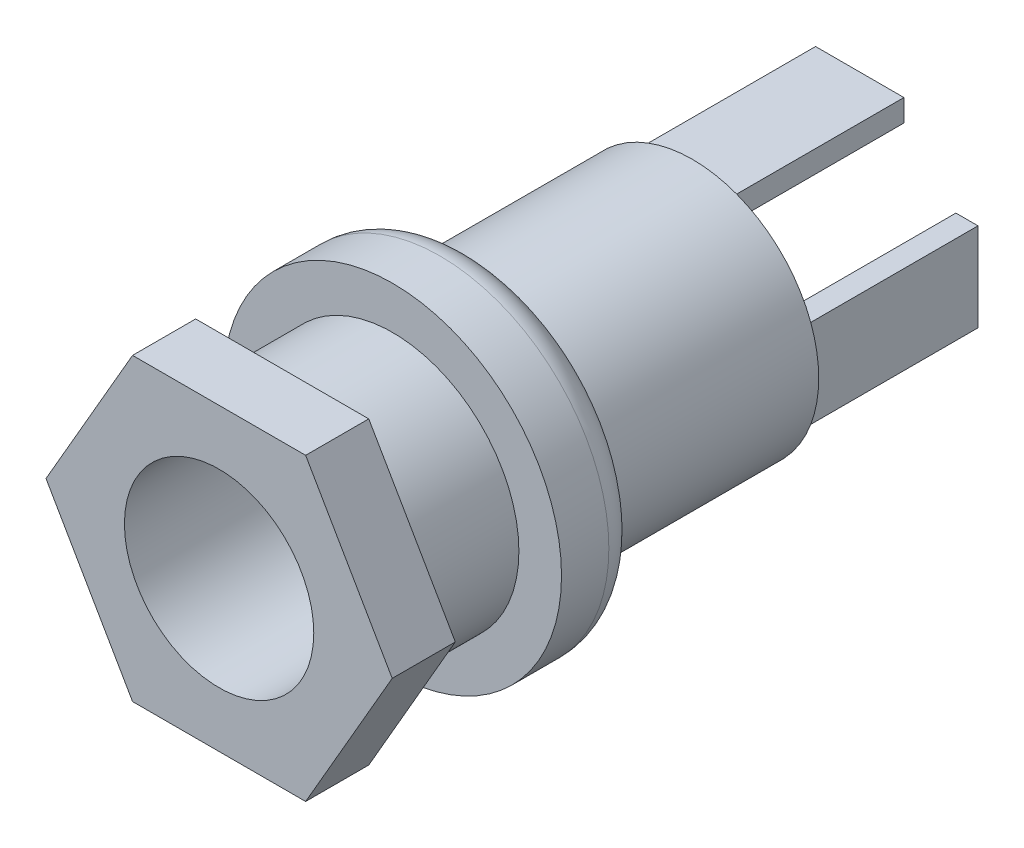
ISO-10303-21;
HEADER;
FILE_DESCRIPTION(('STEP AP214'),'2;1');
FILE_NAME('part.step','',(''),(''),'','','');
FILE_SCHEMA(('AUTOMOTIVE_DESIGN { 1 0 10303 214 1 1 1 1 }'));
ENDSEC;
DATA;
#1=APPLICATION_CONTEXT('core data for automotive mechanical design processes');
#2=APPLICATION_PROTOCOL_DEFINITION('international standard','automotive_design',2000,#1);
#3=PRODUCT_CONTEXT('',#1,'mechanical');
#4=PRODUCT('Part','Part','',(#3));
#5=PRODUCT_RELATED_PRODUCT_CATEGORY('part','',(#4));
#6=PRODUCT_DEFINITION_FORMATION('','',#4);
#7=PRODUCT_DEFINITION_CONTEXT('part definition',#1,'design');
#8=PRODUCT_DEFINITION('design','',#6,#7);
#9=PRODUCT_DEFINITION_SHAPE('','',#8);
#10=(LENGTH_UNIT() NAMED_UNIT(*) SI_UNIT(.MILLI.,.METRE.));
#11=(NAMED_UNIT(*) PLANE_ANGLE_UNIT() SI_UNIT($,.RADIAN.));
#12=(NAMED_UNIT(*) SI_UNIT($,.STERADIAN.) SOLID_ANGLE_UNIT());
#13=UNCERTAINTY_MEASURE_WITH_UNIT(LENGTH_MEASURE(1.E-05),#10,'distance_accuracy_value','');
#14=(GEOMETRIC_REPRESENTATION_CONTEXT(3) GLOBAL_UNCERTAINTY_ASSIGNED_CONTEXT((#13)) GLOBAL_UNIT_ASSIGNED_CONTEXT((#10,
#11,#12)) REPRESENTATION_CONTEXT('',''));
#15=CARTESIAN_POINT('',(0.,0.,0.));
#16=DIRECTION('',(0.,0.,1.));
#17=DIRECTION('',(1.,0.,0.));
#18=AXIS2_PLACEMENT_3D('',#15,#16,#17);
#19=CARTESIAN_POINT('',(0.,0.,-5.5));
#20=DIRECTION('',(0.,0.,1.));
#21=DIRECTION('',(1.,0.,0.));
#22=AXIS2_PLACEMENT_3D('',#19,#20,#21);
#23=CYLINDRICAL_SURFACE('',#22,4.);
#24=CARTESIAN_POINT('',(0.,0.,-5.5));
#25=DIRECTION('',(0.,0.,-1.));
#26=DIRECTION('',(-1.,0.,0.));
#27=AXIS2_PLACEMENT_3D('',#24,#25,#26);
#28=CIRCLE('',#27,4.);
#29=CARTESIAN_POINT('',(-4.,0.,-5.5));
#30=VERTEX_POINT('',#29);
#31=EDGE_CURVE('E319',#30,#30,#28,.F.);
#32=ORIENTED_EDGE('',*,*,#31,.T.);
#33=EDGE_LOOP('',(#32));
#34=FACE_BOUND('',#33,.T.);
#35=CARTESIAN_POINT('',(0.,0.,-2.));
#36=DIRECTION('',(0.,0.,1.));
#37=DIRECTION('',(1.,0.,0.));
#38=AXIS2_PLACEMENT_3D('',#35,#36,#37);
#39=CIRCLE('',#38,4.);
#40=CARTESIAN_POINT('',(4.,0.,-2.));
#41=VERTEX_POINT('',#40);
#42=EDGE_CURVE('E189',#41,#41,#39,.T.);
#43=ORIENTED_EDGE('',*,*,#42,.F.);
#44=EDGE_LOOP('',(#43));
#45=FACE_BOUND('',#44,.T.);
#46=ADVANCED_FACE('F30',(#34,#45),#23,.T.);
#47=CARTESIAN_POINT('',(0.,0.,-15.));
#48=DIRECTION('',(0.,0.,-1.));
#49=DIRECTION('',(-1.,0.,0.));
#50=AXIS2_PLACEMENT_3D('',#47,#48,#49);
#51=PLANE('',#50);
#52=CARTESIAN_POINT('',(0.,0.,-15.));
#53=DIRECTION('',(0.,0.,-1.));
#54=DIRECTION('',(-1.,0.,0.));
#55=AXIS2_PLACEMENT_3D('',#52,#53,#54);
#56=CIRCLE('',#55,4.);
#57=CARTESIAN_POINT('',(-3.74699879903903,-1.4,-15.));
#58=VERTEX_POINT('',#57);
#59=CARTESIAN_POINT('',(-3.74699879903903,1.4,-15.));
#60=VERTEX_POINT('',#59);
#61=EDGE_CURVE('E683',#58,#60,#56,.T.);
#62=ORIENTED_EDGE('',*,*,#61,.T.);
#63=DIRECTION('',(0.,1.,0.));
#64=VECTOR('',#63,1.);
#65=CARTESIAN_POINT('',(-3.74699879903903,-1.4,-15.));
#66=LINE('',#65,#64);
#67=EDGE_CURVE('E211',#58,#60,#66,.T.);
#68=ORIENTED_EDGE('',*,*,#67,.F.);
#69=EDGE_LOOP('',(#62,#68));
#70=FACE_BOUND('',#69,.T.);
#71=ADVANCED_FACE('F341',(#70),#51,.T.);
#72=DIRECTION('',(0.,-1.,0.));
#73=VECTOR('',#72,1.);
#74=CARTESIAN_POINT('',(-3.04699879903904,-1.4,-15.));
#75=LINE('',#74,#73);
#76=CARTESIAN_POINT('',(-3.04699879903904,1.4,-15.));
#77=VERTEX_POINT('',#76);
#78=CARTESIAN_POINT('',(-3.04699879903904,-1.4,-15.));
#79=VERTEX_POINT('',#78);
#80=EDGE_CURVE('E234',#77,#79,#75,.T.);
#81=ORIENTED_EDGE('',*,*,#80,.F.);
#82=DIRECTION('',(1.,0.,0.));
#83=VECTOR('',#82,1.);
#84=CARTESIAN_POINT('',(-3.04699879903904,1.4,-15.));
#85=LINE('',#84,#83);
#86=EDGE_CURVE('E232',#60,#77,#85,.T.);
#87=ORIENTED_EDGE('',*,*,#86,.F.);
#88=CARTESIAN_POINT('',(-1.4,3.74699879903904,-15.));
#89=VERTEX_POINT('',#88);
#90=EDGE_CURVE('E311',#60,#89,#56,.T.);
#91=ORIENTED_EDGE('',*,*,#90,.T.);
#92=DIRECTION('',(0.,1.,0.));
#93=VECTOR('',#92,1.);
#94=CARTESIAN_POINT('',(-1.4,3.04699879903904,-15.));
#95=LINE('',#94,#93);
#96=CARTESIAN_POINT('',(-1.4,3.04699879903904,-15.));
#97=VERTEX_POINT('',#96);
#98=EDGE_CURVE('E289',#97,#89,#95,.T.);
#99=ORIENTED_EDGE('',*,*,#98,.F.);
#100=DIRECTION('',(-1.,0.,0.));
#101=VECTOR('',#100,1.);
#102=CARTESIAN_POINT('',(-1.4,3.04699879903904,-15.));
#103=LINE('',#102,#101);
#104=CARTESIAN_POINT('',(1.4,3.04699879903904,-15.));
#105=VERTEX_POINT('',#104);
#106=EDGE_CURVE('E286',#105,#97,#103,.T.);
#107=ORIENTED_EDGE('',*,*,#106,.F.);
#108=DIRECTION('',(0.,-1.,0.));
#109=VECTOR('',#108,1.);
#110=CARTESIAN_POINT('',(1.4,3.04699879903904,-15.));
#111=LINE('',#110,#109);
#112=CARTESIAN_POINT('',(1.4,3.74699879903903,-15.));
#113=VERTEX_POINT('',#112);
#114=EDGE_CURVE('E272',#113,#105,#111,.T.);
#115=ORIENTED_EDGE('',*,*,#114,.F.);
#116=CARTESIAN_POINT('',(3.74699879903904,1.4,-15.));
#117=VERTEX_POINT('',#116);
#118=EDGE_CURVE('E310',#113,#117,#56,.T.);
#119=ORIENTED_EDGE('',*,*,#118,.T.);
#120=DIRECTION('',(1.,0.,0.));
#121=VECTOR('',#120,1.);
#122=CARTESIAN_POINT('',(3.04699879903904,1.4,-15.));
#123=LINE('',#122,#121);
#124=CARTESIAN_POINT('',(3.04699879903904,1.4,-15.));
#125=VERTEX_POINT('',#124);
#126=EDGE_CURVE('E250',#125,#117,#123,.T.);
#127=ORIENTED_EDGE('',*,*,#126,.F.);
#128=DIRECTION('',(0.,1.,0.));
#129=VECTOR('',#128,1.);
#130=CARTESIAN_POINT('',(3.04699879903903,-1.4,-15.));
#131=LINE('',#130,#129);
#132=CARTESIAN_POINT('',(3.04699879903903,-1.4,-15.));
#133=VERTEX_POINT('',#132);
#134=EDGE_CURVE('E261',#133,#125,#131,.T.);
#135=ORIENTED_EDGE('',*,*,#134,.F.);
#136=DIRECTION('',(-1.,0.,0.));
#137=VECTOR('',#136,1.);
#138=CARTESIAN_POINT('',(3.04699879903903,-1.4,-15.));
#139=LINE('',#138,#137);
#140=CARTESIAN_POINT('',(3.74699879903904,-1.4,-15.));
#141=VERTEX_POINT('',#140);
#142=EDGE_CURVE('E259',#141,#133,#139,.T.);
#143=ORIENTED_EDGE('',*,*,#142,.F.);
#144=EDGE_CURVE('E681',#141,#58,#56,.T.);
#145=ORIENTED_EDGE('',*,*,#144,.T.);
#146=DIRECTION('',(-1.,0.,0.));
#147=VECTOR('',#146,1.);
#148=CARTESIAN_POINT('',(-3.04699879903904,-1.4,-15.));
#149=LINE('',#148,#147);
#150=EDGE_CURVE('E223',#79,#58,#149,.T.);
#151=ORIENTED_EDGE('',*,*,#150,.F.);
#152=EDGE_LOOP('',(#81,#87,#91,#99,#107,#115,#119,#127,#135,#143,#145,#151));
#153=FACE_BOUND('',#152,.T.);
#154=ADVANCED_FACE('F352',(#153),#51,.T.);
#155=EDGE_CURVE('E677',#117,#141,#56,.T.);
#156=ORIENTED_EDGE('',*,*,#155,.T.);
#157=DIRECTION('',(0.,-1.,0.));
#158=VECTOR('',#157,1.);
#159=CARTESIAN_POINT('',(3.74699879903904,-1.4,-15.));
#160=LINE('',#159,#158);
#161=EDGE_CURVE('E245',#117,#141,#160,.T.);
#162=ORIENTED_EDGE('',*,*,#161,.F.);
#163=EDGE_LOOP('',(#156,#162));
#164=FACE_BOUND('',#163,.T.);
#165=ADVANCED_FACE('F342',(#164),#51,.T.);
#166=CARTESIAN_POINT('',(0.,0.,-8.));
#167=DIRECTION('',(0.,0.,-1.));
#168=DIRECTION('',(-1.,0.,0.));
#169=AXIS2_PLACEMENT_3D('',#166,#167,#168);
#170=PLANE('',#169);
#171=CARTESIAN_POINT('',(0.,0.,-8.));
#172=DIRECTION('',(0.,0.,-1.));
#173=DIRECTION('',(-1.,0.,0.));
#174=AXIS2_PLACEMENT_3D('',#171,#172,#173);
#175=CIRCLE('',#174,4.35);
#176=CARTESIAN_POINT('',(-4.35,0.,-8.));
#177=VERTEX_POINT('',#176);
#178=EDGE_CURVE('E38',#177,#177,#175,.T.);
#179=ORIENTED_EDGE('',*,*,#178,.T.);
#180=EDGE_LOOP('',(#179));
#181=FACE_BOUND('',#180,.T.);
#182=CARTESIAN_POINT('',(0.,0.,-8.));
#183=DIRECTION('',(0.,0.,-1.));
#184=DIRECTION('',(-1.,0.,0.));
#185=AXIS2_PLACEMENT_3D('',#182,#183,#184);
#186=CIRCLE('',#185,4.);
#187=CARTESIAN_POINT('',(-4.,0.,-8.));
#188=VERTEX_POINT('',#187);
#189=EDGE_CURVE('E305',#188,#188,#186,.T.);
#190=ORIENTED_EDGE('',*,*,#189,.F.);
#191=EDGE_LOOP('',(#190));
#192=FACE_BOUND('',#191,.T.);
#193=ADVANCED_FACE('F327',(#181,#192),#170,.T.);
#194=CARTESIAN_POINT('',(0.,0.,-5.5));
#195=DIRECTION('',(0.,0.,-1.));
#196=DIRECTION('',(-1.,0.,0.));
#197=AXIS2_PLACEMENT_3D('',#194,#195,#196);
#198=PLANE('',#197);
#199=ORIENTED_EDGE('',*,*,#31,.F.);
#200=EDGE_LOOP('',(#199));
#201=FACE_BOUND('',#200,.T.);
#202=CARTESIAN_POINT('',(0.,0.,-5.5));
#203=DIRECTION('',(0.,0.,-1.));
#204=DIRECTION('',(-1.,0.,0.));
#205=AXIS2_PLACEMENT_3D('',#202,#203,#204);
#206=CIRCLE('',#205,5.35);
#207=CARTESIAN_POINT('',(-5.35,0.,-5.5));
#208=VERTEX_POINT('',#207);
#209=EDGE_CURVE('E316',#208,#208,#206,.T.);
#210=ORIENTED_EDGE('',*,*,#209,.F.);
#211=EDGE_LOOP('',(#210));
#212=FACE_BOUND('',#211,.T.);
#213=ADVANCED_FACE('F343',(#201,#212),#198,.F.);
#214=CARTESIAN_POINT('',(0.,0.,-8.));
#215=DIRECTION('',(0.,0.,1.));
#216=DIRECTION('',(1.,0.,0.));
#217=AXIS2_PLACEMENT_3D('',#214,#215,#216);
#218=CYLINDRICAL_SURFACE('',#217,5.35);
#219=CARTESIAN_POINT('',(0.,0.,-7.));
#220=DIRECTION('',(0.,0.,-1.));
#221=DIRECTION('',(-1.,0.,0.));
#222=AXIS2_PLACEMENT_3D('',#219,#220,#221);
#223=CIRCLE('',#222,5.35);
#224=CARTESIAN_POINT('',(-5.35,0.,-7.));
#225=VERTEX_POINT('',#224);
#226=EDGE_CURVE('E11',#225,#225,#223,.F.);
#227=ORIENTED_EDGE('',*,*,#226,.T.);
#228=EDGE_LOOP('',(#227));
#229=FACE_BOUND('',#228,.T.);
#230=ORIENTED_EDGE('',*,*,#209,.T.);
#231=EDGE_LOOP('',(#230));
#232=FACE_BOUND('',#231,.T.);
#233=ADVANCED_FACE('F332',(#229,#232),#218,.T.);
#234=CARTESIAN_POINT('',(0.,0.,-7.));
#235=DIRECTION('',(0.,0.,-1.));
#236=DIRECTION('',(-1.,0.,0.));
#237=AXIS2_PLACEMENT_3D('',#234,#235,#236);
#238=TOROIDAL_SURFACE('',#237,4.35,1.);
#239=ORIENTED_EDGE('',*,*,#226,.F.);
#240=EDGE_LOOP('',(#239));
#241=FACE_BOUND('',#240,.T.);
#242=ORIENTED_EDGE('',*,*,#178,.F.);
#243=EDGE_LOOP('',(#242));
#244=FACE_BOUND('',#243,.T.);
#245=ADVANCED_FACE('F32',(#241,#244),#238,.T.);
#246=DIRECTION('',(1.,0.,0.));
#247=VECTOR('',#246,1.);
#248=CARTESIAN_POINT('',(-1.4,3.74699879903903,-15.));
#249=LINE('',#248,#247);
#250=EDGE_CURVE('E277',#89,#113,#249,.T.);
#251=ORIENTED_EDGE('',*,*,#250,.F.);
#252=EDGE_CURVE('E306',#89,#113,#56,.T.);
#253=ORIENTED_EDGE('',*,*,#252,.T.);
#254=EDGE_LOOP('',(#251,#253));
#255=FACE_BOUND('',#254,.T.);
#256=ADVANCED_FACE('F331',(#255),#51,.T.);
#257=CARTESIAN_POINT('',(0.,0.,-15.));
#258=DIRECTION('',(0.,0.,1.));
#259=DIRECTION('',(1.,0.,0.));
#260=AXIS2_PLACEMENT_3D('',#257,#258,#259);
#261=CYLINDRICAL_SURFACE('',#260,4.);
#262=ORIENTED_EDGE('',*,*,#252,.F.);
#263=ORIENTED_EDGE('',*,*,#90,.F.);
#264=ORIENTED_EDGE('',*,*,#61,.F.);
#265=ORIENTED_EDGE('',*,*,#144,.F.);
#266=ORIENTED_EDGE('',*,*,#155,.F.);
#267=ORIENTED_EDGE('',*,*,#118,.F.);
#268=EDGE_LOOP('',(#262,#263,#264,#265,#266,#267));
#269=FACE_BOUND('',#268,.T.);
#270=ORIENTED_EDGE('',*,*,#189,.T.);
#271=EDGE_LOOP('',(#270));
#272=FACE_BOUND('',#271,.T.);
#273=ADVANCED_FACE('F338',(#269,#272),#261,.T.);
#274=CARTESIAN_POINT('',(1.4,3.04699879903904,-20.3));
#275=DIRECTION('',(-1.,0.,0.));
#276=DIRECTION('',(0.,0.,1.));
#277=AXIS2_PLACEMENT_3D('',#274,#275,#276);
#278=PLANE('',#277);
#279=ORIENTED_EDGE('',*,*,#114,.T.);
#280=DIRECTION('',(0.,0.,1.));
#281=VECTOR('',#280,1.);
#282=CARTESIAN_POINT('',(1.4,3.04699879903904,-20.3));
#283=LINE('',#282,#281);
#284=CARTESIAN_POINT('',(1.4,3.04699879903904,-20.3));
#285=VERTEX_POINT('',#284);
#286=EDGE_CURVE('E302',#285,#105,#283,.T.);
#287=ORIENTED_EDGE('',*,*,#286,.F.);
#288=DIRECTION('',(0.,-1.,0.));
#289=VECTOR('',#288,1.);
#290=CARTESIAN_POINT('',(1.4,3.04699879903904,-20.3));
#291=LINE('',#290,#289);
#292=CARTESIAN_POINT('',(1.4,3.74699879903903,-20.3));
#293=VERTEX_POINT('',#292);
#294=EDGE_CURVE('E273',#293,#285,#291,.T.);
#295=ORIENTED_EDGE('',*,*,#294,.F.);
#296=DIRECTION('',(0.,0.,1.));
#297=VECTOR('',#296,1.);
#298=CARTESIAN_POINT('',(1.4,3.74699879903903,-20.3));
#299=LINE('',#298,#297);
#300=EDGE_CURVE('E283',#293,#113,#299,.T.);
#301=ORIENTED_EDGE('',*,*,#300,.T.);
#302=EDGE_LOOP('',(#279,#287,#295,#301));
#303=FACE_BOUND('',#302,.T.);
#304=ADVANCED_FACE('F372',(#303),#278,.F.);
#305=CARTESIAN_POINT('',(-1.4,3.04699879903904,-20.3));
#306=DIRECTION('',(0.,1.,0.));
#307=DIRECTION('',(-1.,0.,0.));
#308=AXIS2_PLACEMENT_3D('',#305,#306,#307);
#309=PLANE('',#308);
#310=ORIENTED_EDGE('',*,*,#106,.T.);
#311=DIRECTION('',(0.,0.,1.));
#312=VECTOR('',#311,1.);
#313=CARTESIAN_POINT('',(-1.4,3.04699879903904,-20.3));
#314=LINE('',#313,#312);
#315=CARTESIAN_POINT('',(-1.4,3.04699879903904,-20.3));
#316=VERTEX_POINT('',#315);
#317=EDGE_CURVE('E299',#316,#97,#314,.T.);
#318=ORIENTED_EDGE('',*,*,#317,.F.);
#319=DIRECTION('',(-1.,0.,0.));
#320=VECTOR('',#319,1.);
#321=CARTESIAN_POINT('',(-1.4,3.04699879903904,-20.3));
#322=LINE('',#321,#320);
#323=EDGE_CURVE('E276',#285,#316,#322,.T.);
#324=ORIENTED_EDGE('',*,*,#323,.F.);
#325=ORIENTED_EDGE('',*,*,#286,.T.);
#326=EDGE_LOOP('',(#310,#318,#324,#325));
#327=FACE_BOUND('',#326,.T.);
#328=ADVANCED_FACE('F379',(#327),#309,.F.);
#329=CARTESIAN_POINT('',(-1.4,3.04699879903904,-20.3));
#330=DIRECTION('',(1.,0.,0.));
#331=DIRECTION('',(0.,1.,0.));
#332=AXIS2_PLACEMENT_3D('',#329,#330,#331);
#333=PLANE('',#332);
#334=ORIENTED_EDGE('',*,*,#98,.T.);
#335=DIRECTION('',(0.,0.,1.));
#336=VECTOR('',#335,1.);
#337=CARTESIAN_POINT('',(-1.4,3.74699879903903,-20.3));
#338=LINE('',#337,#336);
#339=CARTESIAN_POINT('',(-1.4,3.74699879903903,-20.3));
#340=VERTEX_POINT('',#339);
#341=EDGE_CURVE('E296',#340,#89,#338,.T.);
#342=ORIENTED_EDGE('',*,*,#341,.F.);
#343=DIRECTION('',(0.,1.,0.));
#344=VECTOR('',#343,1.);
#345=CARTESIAN_POINT('',(-1.4,3.04699879903904,-20.3));
#346=LINE('',#345,#344);
#347=EDGE_CURVE('E279',#316,#340,#346,.T.);
#348=ORIENTED_EDGE('',*,*,#347,.F.);
#349=ORIENTED_EDGE('',*,*,#317,.T.);
#350=EDGE_LOOP('',(#334,#342,#348,#349));
#351=FACE_BOUND('',#350,.T.);
#352=ADVANCED_FACE('F383',(#351),#333,.F.);
#353=CARTESIAN_POINT('',(-1.4,3.74699879903903,-20.3));
#354=DIRECTION('',(0.,-1.,0.));
#355=DIRECTION('',(1.,0.,0.));
#356=AXIS2_PLACEMENT_3D('',#353,#354,#355);
#357=PLANE('',#356);
#358=ORIENTED_EDGE('',*,*,#250,.T.);
#359=ORIENTED_EDGE('',*,*,#300,.F.);
#360=DIRECTION('',(1.,0.,0.));
#361=VECTOR('',#360,1.);
#362=CARTESIAN_POINT('',(-1.4,3.74699879903903,-20.3));
#363=LINE('',#362,#361);
#364=EDGE_CURVE('E281',#340,#293,#363,.T.);
#365=ORIENTED_EDGE('',*,*,#364,.F.);
#366=ORIENTED_EDGE('',*,*,#341,.T.);
#367=EDGE_LOOP('',(#358,#359,#365,#366));
#368=FACE_BOUND('',#367,.T.);
#369=ADVANCED_FACE('F387',(#368),#357,.F.);
#370=CARTESIAN_POINT('',(1.4,3.74699879903903,-20.3));
#371=DIRECTION('',(0.,0.,-1.));
#372=DIRECTION('',(-1.,0.,0.));
#373=AXIS2_PLACEMENT_3D('',#370,#371,#372);
#374=PLANE('',#373);
#375=ORIENTED_EDGE('',*,*,#294,.T.);
#376=ORIENTED_EDGE('',*,*,#323,.T.);
#377=ORIENTED_EDGE('',*,*,#347,.T.);
#378=ORIENTED_EDGE('',*,*,#364,.T.);
#379=EDGE_LOOP('',(#375,#376,#377,#378));
#380=FACE_BOUND('',#379,.T.);
#381=ADVANCED_FACE('F391',(#380),#374,.T.);
#382=CARTESIAN_POINT('',(3.74699879903904,-1.4,-20.3));
#383=DIRECTION('',(-1.,0.,0.));
#384=DIRECTION('',(0.,0.,1.));
#385=AXIS2_PLACEMENT_3D('',#382,#383,#384);
#386=PLANE('',#385);
#387=ORIENTED_EDGE('',*,*,#161,.T.);
#388=DIRECTION('',(0.,0.,1.));
#389=VECTOR('',#388,1.);
#390=CARTESIAN_POINT('',(3.74699879903904,-1.4,-20.3));
#391=LINE('',#390,#389);
#392=CARTESIAN_POINT('',(3.74699879903904,-1.4,-20.3));
#393=VERTEX_POINT('',#392);
#394=EDGE_CURVE('E270',#393,#141,#391,.T.);
#395=ORIENTED_EDGE('',*,*,#394,.F.);
#396=DIRECTION('',(0.,-1.,0.));
#397=VECTOR('',#396,1.);
#398=CARTESIAN_POINT('',(3.74699879903904,-1.4,-20.3));
#399=LINE('',#398,#397);
#400=CARTESIAN_POINT('',(3.74699879903904,1.4,-20.3));
#401=VERTEX_POINT('',#400);
#402=EDGE_CURVE('E246',#401,#393,#399,.T.);
#403=ORIENTED_EDGE('',*,*,#402,.F.);
#404=DIRECTION('',(0.,0.,1.));
#405=VECTOR('',#404,1.);
#406=CARTESIAN_POINT('',(3.74699879903904,1.4,-20.3));
#407=LINE('',#406,#405);
#408=EDGE_CURVE('E256',#401,#117,#407,.T.);
#409=ORIENTED_EDGE('',*,*,#408,.T.);
#410=EDGE_LOOP('',(#387,#395,#403,#409));
#411=FACE_BOUND('',#410,.T.);
#412=ADVANCED_FACE('F395',(#411),#386,.F.);
#413=CARTESIAN_POINT('',(3.04699879903903,-1.4,-20.3));
#414=DIRECTION('',(0.,1.,0.));
#415=DIRECTION('',(0.,0.,1.));
#416=AXIS2_PLACEMENT_3D('',#413,#414,#415);
#417=PLANE('',#416);
#418=ORIENTED_EDGE('',*,*,#142,.T.);
#419=DIRECTION('',(0.,0.,1.));
#420=VECTOR('',#419,1.);
#421=CARTESIAN_POINT('',(3.04699879903903,-1.4,-20.3));
#422=LINE('',#421,#420);
#423=CARTESIAN_POINT('',(3.04699879903903,-1.4,-20.3));
#424=VERTEX_POINT('',#423);
#425=EDGE_CURVE('E267',#424,#133,#422,.T.);
#426=ORIENTED_EDGE('',*,*,#425,.F.);
#427=DIRECTION('',(-1.,0.,0.));
#428=VECTOR('',#427,1.);
#429=CARTESIAN_POINT('',(3.04699879903903,-1.4,-20.3));
#430=LINE('',#429,#428);
#431=EDGE_CURVE('E249',#393,#424,#430,.T.);
#432=ORIENTED_EDGE('',*,*,#431,.F.);
#433=ORIENTED_EDGE('',*,*,#394,.T.);
#434=EDGE_LOOP('',(#418,#426,#432,#433));
#435=FACE_BOUND('',#434,.T.);
#436=ADVANCED_FACE('F399',(#435),#417,.F.);
#437=CARTESIAN_POINT('',(3.04699879903903,-1.4,-20.3));
#438=DIRECTION('',(1.,0.,0.));
#439=DIRECTION('',(0.,1.,0.));
#440=AXIS2_PLACEMENT_3D('',#437,#438,#439);
#441=PLANE('',#440);
#442=ORIENTED_EDGE('',*,*,#134,.T.);
#443=DIRECTION('',(0.,0.,1.));
#444=VECTOR('',#443,1.);
#445=CARTESIAN_POINT('',(3.04699879903904,1.4,-20.3));
#446=LINE('',#445,#444);
#447=CARTESIAN_POINT('',(3.04699879903904,1.4,-20.3));
#448=VERTEX_POINT('',#447);
#449=EDGE_CURVE('E53',#448,#125,#446,.T.);
#450=ORIENTED_EDGE('',*,*,#449,.F.);
#451=DIRECTION('',(0.,1.,0.));
#452=VECTOR('',#451,1.);
#453=CARTESIAN_POINT('',(3.04699879903903,-1.4,-20.3));
#454=LINE('',#453,#452);
#455=EDGE_CURVE('E252',#424,#448,#454,.T.);
#456=ORIENTED_EDGE('',*,*,#455,.F.);
#457=ORIENTED_EDGE('',*,*,#425,.T.);
#458=EDGE_LOOP('',(#442,#450,#456,#457));
#459=FACE_BOUND('',#458,.T.);
#460=ADVANCED_FACE('F403',(#459),#441,.F.);
#461=CARTESIAN_POINT('',(3.04699879903904,1.4,-20.3));
#462=DIRECTION('',(0.,-1.,0.));
#463=DIRECTION('',(1.,0.,0.));
#464=AXIS2_PLACEMENT_3D('',#461,#462,#463);
#465=PLANE('',#464);
#466=ORIENTED_EDGE('',*,*,#126,.T.);
#467=ORIENTED_EDGE('',*,*,#408,.F.);
#468=DIRECTION('',(1.,0.,0.));
#469=VECTOR('',#468,1.);
#470=CARTESIAN_POINT('',(3.04699879903904,1.4,-20.3));
#471=LINE('',#470,#469);
#472=EDGE_CURVE('E254',#448,#401,#471,.T.);
#473=ORIENTED_EDGE('',*,*,#472,.F.);
#474=ORIENTED_EDGE('',*,*,#449,.T.);
#475=EDGE_LOOP('',(#466,#467,#473,#474));
#476=FACE_BOUND('',#475,.T.);
#477=ADVANCED_FACE('F407',(#476),#465,.F.);
#478=CARTESIAN_POINT('',(3.74699879903904,1.4,-20.3));
#479=DIRECTION('',(0.,0.,-1.));
#480=DIRECTION('',(-1.,0.,0.));
#481=AXIS2_PLACEMENT_3D('',#478,#479,#480);
#482=PLANE('',#481);
#483=ORIENTED_EDGE('',*,*,#402,.T.);
#484=ORIENTED_EDGE('',*,*,#431,.T.);
#485=ORIENTED_EDGE('',*,*,#455,.T.);
#486=ORIENTED_EDGE('',*,*,#472,.T.);
#487=EDGE_LOOP('',(#483,#484,#485,#486));
#488=FACE_BOUND('',#487,.T.);
#489=ADVANCED_FACE('F411',(#488),#482,.T.);
#490=CARTESIAN_POINT('',(-3.74699879903903,-1.4,-20.3));
#491=DIRECTION('',(1.,0.,0.));
#492=DIRECTION('',(0.,0.,-1.));
#493=AXIS2_PLACEMENT_3D('',#490,#491,#492);
#494=PLANE('',#493);
#495=ORIENTED_EDGE('',*,*,#67,.T.);
#496=DIRECTION('',(0.,0.,1.));
#497=VECTOR('',#496,1.);
#498=CARTESIAN_POINT('',(-3.74699879903903,1.4,-20.3));
#499=LINE('',#498,#497);
#500=CARTESIAN_POINT('',(-3.74699879903903,1.4,-20.3));
#501=VERTEX_POINT('',#500);
#502=EDGE_CURVE('E243',#501,#60,#499,.T.);
#503=ORIENTED_EDGE('',*,*,#502,.F.);
#504=DIRECTION('',(0.,1.,0.));
#505=VECTOR('',#504,1.);
#506=CARTESIAN_POINT('',(-3.74699879903903,-1.4,-20.3));
#507=LINE('',#506,#505);
#508=CARTESIAN_POINT('',(-3.74699879903903,-1.4,-20.3));
#509=VERTEX_POINT('',#508);
#510=EDGE_CURVE('E219',#509,#501,#507,.T.);
#511=ORIENTED_EDGE('',*,*,#510,.F.);
#512=DIRECTION('',(0.,0.,1.));
#513=VECTOR('',#512,1.);
#514=CARTESIAN_POINT('',(-3.74699879903903,-1.4,-20.3));
#515=LINE('',#514,#513);
#516=EDGE_CURVE('E229',#509,#58,#515,.T.);
#517=ORIENTED_EDGE('',*,*,#516,.T.);
#518=EDGE_LOOP('',(#495,#503,#511,#517));
#519=FACE_BOUND('',#518,.T.);
#520=ADVANCED_FACE('F414',(#519),#494,.F.);
#521=CARTESIAN_POINT('',(-3.04699879903904,1.4,-20.3));
#522=DIRECTION('',(0.,-1.,0.));
#523=DIRECTION('',(0.,0.,-1.));
#524=AXIS2_PLACEMENT_3D('',#521,#522,#523);
#525=PLANE('',#524);
#526=ORIENTED_EDGE('',*,*,#86,.T.);
#527=DIRECTION('',(0.,0.,1.));
#528=VECTOR('',#527,1.);
#529=CARTESIAN_POINT('',(-3.04699879903904,1.4,-20.3));
#530=LINE('',#529,#528);
#531=CARTESIAN_POINT('',(-3.04699879903904,1.4,-20.3));
#532=VERTEX_POINT('',#531);
#533=EDGE_CURVE('E240',#532,#77,#530,.T.);
#534=ORIENTED_EDGE('',*,*,#533,.F.);
#535=DIRECTION('',(1.,0.,0.));
#536=VECTOR('',#535,1.);
#537=CARTESIAN_POINT('',(-3.04699879903904,1.4,-20.3));
#538=LINE('',#537,#536);
#539=EDGE_CURVE('E222',#501,#532,#538,.T.);
#540=ORIENTED_EDGE('',*,*,#539,.F.);
#541=ORIENTED_EDGE('',*,*,#502,.T.);
#542=EDGE_LOOP('',(#526,#534,#540,#541));
#543=FACE_BOUND('',#542,.T.);
#544=ADVANCED_FACE('F418',(#543),#525,.F.);
#545=CARTESIAN_POINT('',(-3.04699879903904,-1.4,-20.3));
#546=DIRECTION('',(-1.,0.,0.));
#547=DIRECTION('',(0.,0.,1.));
#548=AXIS2_PLACEMENT_3D('',#545,#546,#547);
#549=PLANE('',#548);
#550=ORIENTED_EDGE('',*,*,#80,.T.);
#551=DIRECTION('',(0.,0.,1.));
#552=VECTOR('',#551,1.);
#553=CARTESIAN_POINT('',(-3.04699879903904,-1.4,-20.3));
#554=LINE('',#553,#552);
#555=CARTESIAN_POINT('',(-3.04699879903904,-1.4,-20.3));
#556=VERTEX_POINT('',#555);
#557=EDGE_CURVE('E45',#556,#79,#554,.T.);
#558=ORIENTED_EDGE('',*,*,#557,.F.);
#559=DIRECTION('',(0.,-1.,0.));
#560=VECTOR('',#559,1.);
#561=CARTESIAN_POINT('',(-3.04699879903904,-1.4,-20.3));
#562=LINE('',#561,#560);
#563=EDGE_CURVE('E225',#532,#556,#562,.T.);
#564=ORIENTED_EDGE('',*,*,#563,.F.);
#565=ORIENTED_EDGE('',*,*,#533,.T.);
#566=EDGE_LOOP('',(#550,#558,#564,#565));
#567=FACE_BOUND('',#566,.T.);
#568=ADVANCED_FACE('F422',(#567),#549,.F.);
#569=CARTESIAN_POINT('',(-3.04699879903904,-1.4,-20.3));
#570=DIRECTION('',(0.,1.,0.));
#571=DIRECTION('',(0.,0.,1.));
#572=AXIS2_PLACEMENT_3D('',#569,#570,#571);
#573=PLANE('',#572);
#574=ORIENTED_EDGE('',*,*,#150,.T.);
#575=ORIENTED_EDGE('',*,*,#516,.F.);
#576=DIRECTION('',(-1.,0.,0.));
#577=VECTOR('',#576,1.);
#578=CARTESIAN_POINT('',(-3.04699879903904,-1.4,-20.3));
#579=LINE('',#578,#577);
#580=EDGE_CURVE('E227',#556,#509,#579,.T.);
#581=ORIENTED_EDGE('',*,*,#580,.F.);
#582=ORIENTED_EDGE('',*,*,#557,.T.);
#583=EDGE_LOOP('',(#574,#575,#581,#582));
#584=FACE_BOUND('',#583,.T.);
#585=ADVANCED_FACE('F426',(#584),#573,.F.);
#586=CARTESIAN_POINT('',(-3.74699879903903,1.4,-20.3));
#587=DIRECTION('',(0.,0.,1.));
#588=DIRECTION('',(1.,0.,0.));
#589=AXIS2_PLACEMENT_3D('',#586,#587,#588);
#590=PLANE('',#589);
#591=ORIENTED_EDGE('',*,*,#510,.T.);
#592=ORIENTED_EDGE('',*,*,#539,.T.);
#593=ORIENTED_EDGE('',*,*,#563,.T.);
#594=ORIENTED_EDGE('',*,*,#580,.T.);
#595=EDGE_LOOP('',(#591,#592,#593,#594));
#596=FACE_BOUND('',#595,.T.);
#597=ADVANCED_FACE('F430',(#596),#590,.F.);
#598=CARTESIAN_POINT('',(2.74241377865072,-4.75,-2.));
#599=DIRECTION('',(0.866025403784439,-0.499999999999999,0.));
#600=DIRECTION('',(0.499999999999999,0.866025403784439,0.));
#601=AXIS2_PLACEMENT_3D('',#598,#599,#600);
#602=PLANE('',#601);
#603=DIRECTION('',(0.499999999999999,0.866025403784439,0.));
#604=VECTOR('',#603,1.);
#605=CARTESIAN_POINT('',(2.74241377865072,-4.75,0.));
#606=LINE('',#605,#604);
#607=CARTESIAN_POINT('',(2.74241377865072,-4.75,0.));
#608=VERTEX_POINT('',#607);
#609=CARTESIAN_POINT('',(5.48482755730144,0.,0.));
#610=VERTEX_POINT('',#609);
#611=EDGE_CURVE('E199',#608,#610,#606,.T.);
#612=ORIENTED_EDGE('',*,*,#611,.F.);
#613=DIRECTION('',(0.,0.,1.));
#614=VECTOR('',#613,1.);
#615=CARTESIAN_POINT('',(2.74241377865072,-4.75,-2.));
#616=LINE('',#615,#614);
#617=CARTESIAN_POINT('',(2.74241377865072,-4.75,-2.));
#618=VERTEX_POINT('',#617);
#619=EDGE_CURVE('E182',#618,#608,#616,.T.);
#620=ORIENTED_EDGE('',*,*,#619,.F.);
#621=DIRECTION('',(0.499999999999999,0.866025403784439,0.));
#622=VECTOR('',#621,1.);
#623=CARTESIAN_POINT('',(2.74241377865072,-4.75,-2.));
#624=LINE('',#623,#622);
#625=CARTESIAN_POINT('',(5.48482755730144,0.,-2.));
#626=VERTEX_POINT('',#625);
#627=EDGE_CURVE('E175',#618,#626,#624,.T.);
#628=ORIENTED_EDGE('',*,*,#627,.T.);
#629=DIRECTION('',(0.,0.,1.));
#630=VECTOR('',#629,1.);
#631=CARTESIAN_POINT('',(5.48482755730144,0.,-2.));
#632=LINE('',#631,#630);
#633=EDGE_CURVE('E157',#626,#610,#632,.T.);
#634=ORIENTED_EDGE('',*,*,#633,.T.);
#635=EDGE_LOOP('',(#612,#620,#628,#634));
#636=FACE_BOUND('',#635,.T.);
#637=ADVANCED_FACE('F181',(#636),#602,.T.);
#638=CARTESIAN_POINT('',(-2.74241377865072,-4.75,-2.));
#639=DIRECTION('',(0.,-1.,0.));
#640=DIRECTION('',(1.,0.,0.));
#641=AXIS2_PLACEMENT_3D('',#638,#639,#640);
#642=PLANE('',#641);
#643=DIRECTION('',(1.,0.,0.));
#644=VECTOR('',#643,1.);
#645=CARTESIAN_POINT('',(-2.74241377865072,-4.75,0.));
#646=LINE('',#645,#644);
#647=CARTESIAN_POINT('',(-2.74241377865072,-4.75,0.));
#648=VERTEX_POINT('',#647);
#649=EDGE_CURVE('E183',#648,#608,#646,.T.);
#650=ORIENTED_EDGE('',*,*,#649,.F.);
#651=DIRECTION('',(0.,0.,1.));
#652=VECTOR('',#651,1.);
#653=CARTESIAN_POINT('',(-2.74241377865072,-4.75,-2.));
#654=LINE('',#653,#652);
#655=CARTESIAN_POINT('',(-2.74241377865072,-4.75,-2.));
#656=VERTEX_POINT('',#655);
#657=EDGE_CURVE('E212',#656,#648,#654,.T.);
#658=ORIENTED_EDGE('',*,*,#657,.F.);
#659=DIRECTION('',(1.,0.,0.));
#660=VECTOR('',#659,1.);
#661=CARTESIAN_POINT('',(-2.74241377865072,-4.75,-2.));
#662=LINE('',#661,#660);
#663=EDGE_CURVE('E168',#656,#618,#662,.T.);
#664=ORIENTED_EDGE('',*,*,#663,.T.);
#665=ORIENTED_EDGE('',*,*,#619,.T.);
#666=EDGE_LOOP('',(#650,#658,#664,#665));
#667=FACE_BOUND('',#666,.T.);
#668=ADVANCED_FACE('F436',(#667),#642,.T.);
#669=CARTESIAN_POINT('',(-5.48482755730144,0.,-2.));
#670=DIRECTION('',(-0.866025403784438,-0.5,0.));
#671=DIRECTION('',(0.5,-0.866025403784439,0.));
#672=AXIS2_PLACEMENT_3D('',#669,#670,#671);
#673=PLANE('',#672);
#674=DIRECTION('',(0.5,-0.866025403784438,0.));
#675=VECTOR('',#674,1.);
#676=CARTESIAN_POINT('',(-5.48482755730144,0.,0.));
#677=LINE('',#676,#675);
#678=CARTESIAN_POINT('',(-5.48482755730144,0.,0.));
#679=VERTEX_POINT('',#678);
#680=EDGE_CURVE('E186',#679,#648,#677,.T.);
#681=ORIENTED_EDGE('',*,*,#680,.F.);
#682=DIRECTION('',(0.,0.,1.));
#683=VECTOR('',#682,1.);
#684=CARTESIAN_POINT('',(-5.48482755730144,0.,-2.));
#685=LINE('',#684,#683);
#686=CARTESIAN_POINT('',(-5.48482755730144,0.,-2.));
#687=VERTEX_POINT('',#686);
#688=EDGE_CURVE('E214',#687,#679,#685,.T.);
#689=ORIENTED_EDGE('',*,*,#688,.F.);
#690=DIRECTION('',(0.5,-0.866025403784438,0.));
#691=VECTOR('',#690,1.);
#692=CARTESIAN_POINT('',(-5.48482755730144,0.,-2.));
#693=LINE('',#692,#691);
#694=EDGE_CURVE('E195',#687,#656,#693,.T.);
#695=ORIENTED_EDGE('',*,*,#694,.T.);
#696=ORIENTED_EDGE('',*,*,#657,.T.);
#697=EDGE_LOOP('',(#681,#689,#695,#696));
#698=FACE_BOUND('',#697,.T.);
#699=ADVANCED_FACE('F446',(#698),#673,.T.);
#700=CARTESIAN_POINT('',(-2.74241377865072,4.75,-2.));
#701=DIRECTION('',(-0.866025403784439,0.499999999999999,0.));
#702=DIRECTION('',(-0.499999999999999,-0.866025403784439,0.));
#703=AXIS2_PLACEMENT_3D('',#700,#701,#702);
#704=PLANE('',#703);
#705=DIRECTION('',(-0.499999999999999,-0.866025403784439,0.));
#706=VECTOR('',#705,1.);
#707=CARTESIAN_POINT('',(-2.74241377865072,4.75,0.));
#708=LINE('',#707,#706);
#709=CARTESIAN_POINT('',(-2.74241377865072,4.75,0.));
#710=VERTEX_POINT('',#709);
#711=EDGE_CURVE('E205',#710,#679,#708,.T.);
#712=ORIENTED_EDGE('',*,*,#711,.F.);
#713=DIRECTION('',(0.,0.,1.));
#714=VECTOR('',#713,1.);
#715=CARTESIAN_POINT('',(-2.74241377865072,4.75,-2.));
#716=LINE('',#715,#714);
#717=CARTESIAN_POINT('',(-2.74241377865072,4.75,-2.));
#718=VERTEX_POINT('',#717);
#719=EDGE_CURVE('E216',#718,#710,#716,.T.);
#720=ORIENTED_EDGE('',*,*,#719,.F.);
#721=DIRECTION('',(-0.499999999999999,-0.866025403784439,0.));
#722=VECTOR('',#721,1.);
#723=CARTESIAN_POINT('',(-2.74241377865072,4.75,-2.));
#724=LINE('',#723,#722);
#725=EDGE_CURVE('E192',#718,#687,#724,.T.);
#726=ORIENTED_EDGE('',*,*,#725,.T.);
#727=ORIENTED_EDGE('',*,*,#688,.T.);
#728=EDGE_LOOP('',(#712,#720,#726,#727));
#729=FACE_BOUND('',#728,.T.);
#730=ADVANCED_FACE('F442',(#729),#704,.T.);
#731=CARTESIAN_POINT('',(2.74241377865072,4.75,-2.));
#732=DIRECTION('',(0.,1.,0.));
#733=DIRECTION('',(-1.,0.,0.));
#734=AXIS2_PLACEMENT_3D('',#731,#732,#733);
#735=PLANE('',#734);
#736=DIRECTION('',(-1.,0.,0.));
#737=VECTOR('',#736,1.);
#738=CARTESIAN_POINT('',(2.74241377865072,4.75,0.));
#739=LINE('',#738,#737);
#740=CARTESIAN_POINT('',(2.74241377865072,4.75,0.));
#741=VERTEX_POINT('',#740);
#742=EDGE_CURVE('E202',#741,#710,#739,.T.);
#743=ORIENTED_EDGE('',*,*,#742,.F.);
#744=DIRECTION('',(0.,0.,1.));
#745=VECTOR('',#744,1.);
#746=CARTESIAN_POINT('',(2.74241377865072,4.75,-2.));
#747=LINE('',#746,#745);
#748=CARTESIAN_POINT('',(2.74241377865072,4.75,-2.));
#749=VERTEX_POINT('',#748);
#750=EDGE_CURVE('E167',#749,#741,#747,.T.);
#751=ORIENTED_EDGE('',*,*,#750,.F.);
#752=DIRECTION('',(-1.,0.,0.));
#753=VECTOR('',#752,1.);
#754=CARTESIAN_POINT('',(2.74241377865072,4.75,-2.));
#755=LINE('',#754,#753);
#756=EDGE_CURVE('E179',#749,#718,#755,.T.);
#757=ORIENTED_EDGE('',*,*,#756,.T.);
#758=ORIENTED_EDGE('',*,*,#719,.T.);
#759=EDGE_LOOP('',(#743,#751,#757,#758));
#760=FACE_BOUND('',#759,.T.);
#761=ADVANCED_FACE('F439',(#760),#735,.T.);
#762=CARTESIAN_POINT('',(5.48482755730144,0.,-2.));
#763=DIRECTION('',(0.866025403784439,0.5,0.));
#764=DIRECTION('',(-0.5,0.866025403784438,0.));
#765=AXIS2_PLACEMENT_3D('',#762,#763,#764);
#766=PLANE('',#765);
#767=DIRECTION('',(-0.5,0.866025403784438,0.));
#768=VECTOR('',#767,1.);
#769=CARTESIAN_POINT('',(5.48482755730144,0.,0.));
#770=LINE('',#769,#768);
#771=EDGE_CURVE('E162',#610,#741,#770,.T.);
#772=ORIENTED_EDGE('',*,*,#771,.F.);
#773=ORIENTED_EDGE('',*,*,#633,.F.);
#774=DIRECTION('',(-0.5,0.866025403784438,0.));
#775=VECTOR('',#774,1.);
#776=CARTESIAN_POINT('',(5.48482755730144,0.,-2.));
#777=LINE('',#776,#775);
#778=EDGE_CURVE('E160',#626,#749,#777,.T.);
#779=ORIENTED_EDGE('',*,*,#778,.T.);
#780=ORIENTED_EDGE('',*,*,#750,.T.);
#781=EDGE_LOOP('',(#772,#773,#779,#780));
#782=FACE_BOUND('',#781,.T.);
#783=ADVANCED_FACE('F159',(#782),#766,.T.);
#784=CARTESIAN_POINT('',(5.48482755730144,0.,-2.));
#785=DIRECTION('',(0.,0.,1.));
#786=DIRECTION('',(1.,0.,0.));
#787=AXIS2_PLACEMENT_3D('',#784,#785,#786);
#788=PLANE('',#787);
#789=ORIENTED_EDGE('',*,*,#42,.T.);
#790=EDGE_LOOP('',(#789));
#791=FACE_BOUND('',#790,.T.);
#792=ORIENTED_EDGE('',*,*,#627,.F.);
#793=ORIENTED_EDGE('',*,*,#663,.F.);
#794=ORIENTED_EDGE('',*,*,#694,.F.);
#795=ORIENTED_EDGE('',*,*,#725,.F.);
#796=ORIENTED_EDGE('',*,*,#756,.F.);
#797=ORIENTED_EDGE('',*,*,#778,.F.);
#798=EDGE_LOOP('',(#792,#793,#794,#795,#796,#797));
#799=FACE_BOUND('',#798,.T.);
#800=ADVANCED_FACE('F173',(#791,#799),#788,.F.);
#801=CARTESIAN_POINT('',(0.,0.,-8.));
#802=DIRECTION('',(0.,0.,-1.));
#803=DIRECTION('',(-1.,0.,0.));
#804=AXIS2_PLACEMENT_3D('',#801,#802,#803);
#805=PLANE('',#804);
#806=CARTESIAN_POINT('',(0.,0.,-8.));
#807=DIRECTION('',(0.,0.,-1.));
#808=DIRECTION('',(-1.,0.,0.));
#809=AXIS2_PLACEMENT_3D('',#806,#807,#808);
#810=CIRCLE('',#809,3.);
#811=CARTESIAN_POINT('',(-3.,0.,-8.));
#812=VERTEX_POINT('',#811);
#813=EDGE_CURVE('E309',#812,#812,#810,.F.);
#814=ORIENTED_EDGE('',*,*,#813,.T.);
#815=EDGE_LOOP('',(#814));
#816=FACE_BOUND('',#815,.T.);
#817=ADVANCED_FACE('F362',(#816),#805,.F.);
#818=CARTESIAN_POINT('',(0.,0.,-5.5));
#819=DIRECTION('',(0.,0.,1.));
#820=DIRECTION('',(1.,0.,0.));
#821=AXIS2_PLACEMENT_3D('',#818,#819,#820);
#822=CYLINDRICAL_SURFACE('',#821,3.);
#823=CARTESIAN_POINT('',(0.,0.,0.));
#824=DIRECTION('',(0.,0.,1.));
#825=DIRECTION('',(1.,0.,0.));
#826=AXIS2_PLACEMENT_3D('',#823,#824,#825);
#827=CIRCLE('',#826,3.);
#828=CARTESIAN_POINT('',(3.,0.,0.));
#829=VERTEX_POINT('',#828);
#830=EDGE_CURVE('E322',#829,#829,#827,.T.);
#831=ORIENTED_EDGE('',*,*,#830,.T.);
#832=EDGE_LOOP('',(#831));
#833=FACE_BOUND('',#832,.T.);
#834=ORIENTED_EDGE('',*,*,#813,.F.);
#835=EDGE_LOOP('',(#834));
#836=FACE_BOUND('',#835,.T.);
#837=ADVANCED_FACE('F359',(#833,#836),#822,.F.);
#838=CARTESIAN_POINT('',(0.,0.,0.));
#839=DIRECTION('',(0.,0.,1.));
#840=DIRECTION('',(1.,0.,0.));
#841=AXIS2_PLACEMENT_3D('',#838,#839,#840);
#842=PLANE('',#841);
#843=ORIENTED_EDGE('',*,*,#830,.F.);
#844=EDGE_LOOP('',(#843));
#845=FACE_BOUND('',#844,.T.);
#846=ORIENTED_EDGE('',*,*,#611,.T.);
#847=ORIENTED_EDGE('',*,*,#771,.T.);
#848=ORIENTED_EDGE('',*,*,#742,.T.);
#849=ORIENTED_EDGE('',*,*,#711,.T.);
#850=ORIENTED_EDGE('',*,*,#680,.T.);
#851=ORIENTED_EDGE('',*,*,#649,.T.);
#852=EDGE_LOOP('',(#846,#847,#848,#849,#850,#851));
#853=FACE_BOUND('',#852,.T.);
#854=ADVANCED_FACE('F356',(#845,#853),#842,.T.);
#855=CLOSED_SHELL('',(#46,#71,#154,#165,#193,#213,#233,#245,#256,#273,#304,#328,#352,#369,#381,
#412,#436,#460,#477,#489,#520,#544,#568,#585,#597,#637,#668,#699,#730,#761,#783,#800,#817,#837,#854));
#856=MANIFOLD_SOLID_BREP('B2',#855);
#857=ADVANCED_BREP_SHAPE_REPRESENTATION('',(#18,#856),#14);
#858=SHAPE_DEFINITION_REPRESENTATION(#9,#857);
ENDSEC;
END-ISO-10303-21;
